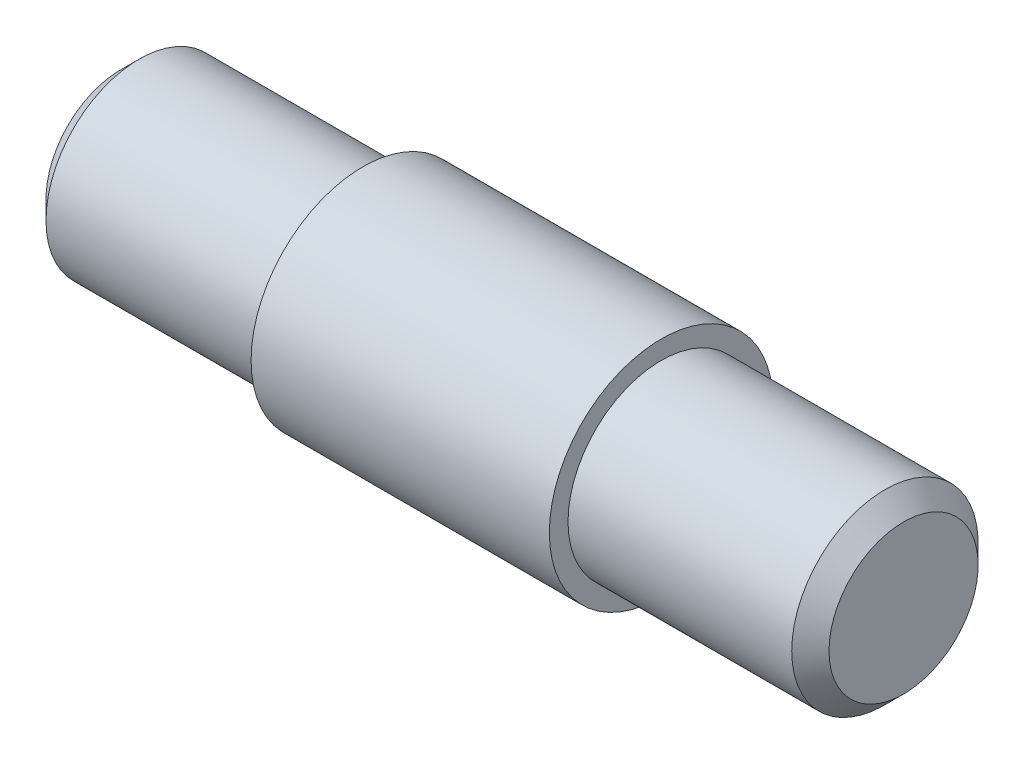
ISO-10303-21;
HEADER;
FILE_DESCRIPTION(('STEP AP214'),'2;1');
FILE_NAME('part.step','',(''),(''),'','','');
FILE_SCHEMA(('AUTOMOTIVE_DESIGN { 1 0 10303 214 1 1 1 1 }'));
ENDSEC;
DATA;
#1=APPLICATION_CONTEXT('core data for automotive mechanical design processes');
#2=APPLICATION_PROTOCOL_DEFINITION('international standard','automotive_design',2000,#1);
#3=PRODUCT_CONTEXT('',#1,'mechanical');
#4=PRODUCT('Part','Part','',(#3));
#5=PRODUCT_RELATED_PRODUCT_CATEGORY('part','',(#4));
#6=PRODUCT_DEFINITION_FORMATION('','',#4);
#7=PRODUCT_DEFINITION_CONTEXT('part definition',#1,'design');
#8=PRODUCT_DEFINITION('design','',#6,#7);
#9=PRODUCT_DEFINITION_SHAPE('','',#8);
#10=(LENGTH_UNIT() NAMED_UNIT(*) SI_UNIT(.MILLI.,.METRE.));
#11=(NAMED_UNIT(*) PLANE_ANGLE_UNIT() SI_UNIT($,.RADIAN.));
#12=(NAMED_UNIT(*) SI_UNIT($,.STERADIAN.) SOLID_ANGLE_UNIT());
#13=UNCERTAINTY_MEASURE_WITH_UNIT(LENGTH_MEASURE(1.E-05),#10,'distance_accuracy_value','');
#14=(GEOMETRIC_REPRESENTATION_CONTEXT(3) GLOBAL_UNCERTAINTY_ASSIGNED_CONTEXT((#13)) GLOBAL_UNIT_ASSIGNED_CONTEXT((#10,
#11,#12)) REPRESENTATION_CONTEXT('',''));
#15=CARTESIAN_POINT('',(0.,0.,0.));
#16=DIRECTION('',(0.,0.,1.));
#17=DIRECTION('',(1.,0.,0.));
#18=AXIS2_PLACEMENT_3D('',#15,#16,#17);
#19=CARTESIAN_POINT('',(0.,0.,0.));
#20=DIRECTION('',(1.,0.,0.));
#21=DIRECTION('',(0.,0.,-1.));
#22=AXIS2_PLACEMENT_3D('',#19,#20,#21);
#23=PLANE('',#22);
#24=CARTESIAN_POINT('',(0.,0.,0.));
#25=DIRECTION('',(1.,0.,0.));
#26=DIRECTION('',(0.,0.,-1.));
#27=AXIS2_PLACEMENT_3D('',#24,#25,#26);
#28=CIRCLE('',#27,2.);
#29=CARTESIAN_POINT('',(0.,0.,-2.));
#30=VERTEX_POINT('',#29);
#31=EDGE_CURVE('E42',#30,#30,#28,.F.);
#32=ORIENTED_EDGE('',*,*,#31,.T.);
#33=EDGE_LOOP('',(#32));
#34=FACE_BOUND('',#33,.T.);
#35=ADVANCED_FACE('F35',(#34),#23,.F.);
#36=CARTESIAN_POINT('',(-54.8246366619784,0.,0.));
#37=DIRECTION('',(-1.,0.,0.));
#38=DIRECTION('',(0.,0.,1.));
#39=AXIS2_PLACEMENT_3D('',#36,#37,#38);
#40=CYLINDRICAL_SURFACE('',#39,2.5);
#41=CARTESIAN_POINT('',(0.499999999999994,0.,0.));
#42=DIRECTION('',(1.,0.,0.));
#43=DIRECTION('',(0.,0.,-1.));
#44=AXIS2_PLACEMENT_3D('',#41,#42,#43);
#45=CIRCLE('',#44,2.5);
#46=CARTESIAN_POINT('',(0.499999999999994,0.,-2.5));
#47=VERTEX_POINT('',#46);
#48=EDGE_CURVE('E10',#47,#47,#45,.T.);
#49=ORIENTED_EDGE('',*,*,#48,.T.);
#50=EDGE_LOOP('',(#49));
#51=FACE_BOUND('',#50,.T.);
#52=CARTESIAN_POINT('',(6.5,0.,0.));
#53=DIRECTION('',(-1.,0.,0.));
#54=DIRECTION('',(0.,0.,1.));
#55=AXIS2_PLACEMENT_3D('',#52,#53,#54);
#56=CIRCLE('',#55,2.5);
#57=CARTESIAN_POINT('',(6.5,0.,2.5));
#58=VERTEX_POINT('',#57);
#59=EDGE_CURVE('E55',#58,#58,#56,.T.);
#60=ORIENTED_EDGE('',*,*,#59,.T.);
#61=EDGE_LOOP('',(#60));
#62=FACE_BOUND('',#61,.T.);
#63=ADVANCED_FACE('F86',(#51,#62),#40,.T.);
#64=CARTESIAN_POINT('',(6.5,2.5,0.));
#65=DIRECTION('',(1.,0.,0.));
#66=DIRECTION('',(0.,0.,-1.));
#67=AXIS2_PLACEMENT_3D('',#64,#65,#66);
#68=PLANE('',#67);
#69=ORIENTED_EDGE('',*,*,#59,.F.);
#70=EDGE_LOOP('',(#69));
#71=FACE_BOUND('',#70,.T.);
#72=CARTESIAN_POINT('',(6.5,0.,0.));
#73=DIRECTION('',(-1.,0.,0.));
#74=DIRECTION('',(0.,0.,1.));
#75=AXIS2_PLACEMENT_3D('',#72,#73,#74);
#76=CIRCLE('',#75,3.);
#77=CARTESIAN_POINT('',(6.5,0.,3.));
#78=VERTEX_POINT('',#77);
#79=EDGE_CURVE('E58',#78,#78,#76,.T.);
#80=ORIENTED_EDGE('',*,*,#79,.T.);
#81=EDGE_LOOP('',(#80));
#82=FACE_BOUND('',#81,.T.);
#83=ADVANCED_FACE('F91',(#71,#82),#68,.F.);
#84=CARTESIAN_POINT('',(-54.8246366619784,0.,0.));
#85=DIRECTION('',(-1.,0.,0.));
#86=DIRECTION('',(0.,0.,1.));
#87=AXIS2_PLACEMENT_3D('',#84,#85,#86);
#88=CYLINDRICAL_SURFACE('',#87,3.);
#89=ORIENTED_EDGE('',*,*,#79,.F.);
#90=EDGE_LOOP('',(#89));
#91=FACE_BOUND('',#90,.T.);
#92=CARTESIAN_POINT('',(14.5,0.,0.));
#93=DIRECTION('',(-1.,0.,0.));
#94=DIRECTION('',(0.,0.,1.));
#95=AXIS2_PLACEMENT_3D('',#92,#93,#94);
#96=CIRCLE('',#95,3.);
#97=CARTESIAN_POINT('',(14.5,0.,3.));
#98=VERTEX_POINT('',#97);
#99=EDGE_CURVE('E61',#98,#98,#96,.T.);
#100=ORIENTED_EDGE('',*,*,#99,.T.);
#101=EDGE_LOOP('',(#100));
#102=FACE_BOUND('',#101,.T.);
#103=ADVANCED_FACE('F82',(#91,#102),#88,.T.);
#104=CARTESIAN_POINT('',(14.5,3.,0.));
#105=DIRECTION('',(-1.,0.,0.));
#106=DIRECTION('',(0.,0.,1.));
#107=AXIS2_PLACEMENT_3D('',#104,#105,#106);
#108=PLANE('',#107);
#109=ORIENTED_EDGE('',*,*,#99,.F.);
#110=EDGE_LOOP('',(#109));
#111=FACE_BOUND('',#110,.T.);
#112=CARTESIAN_POINT('',(14.5,0.,0.));
#113=DIRECTION('',(-1.,0.,0.));
#114=DIRECTION('',(0.,0.,1.));
#115=AXIS2_PLACEMENT_3D('',#112,#113,#114);
#116=CIRCLE('',#115,2.5);
#117=CARTESIAN_POINT('',(14.5,0.,2.5));
#118=VERTEX_POINT('',#117);
#119=EDGE_CURVE('E64',#118,#118,#116,.T.);
#120=ORIENTED_EDGE('',*,*,#119,.T.);
#121=EDGE_LOOP('',(#120));
#122=FACE_BOUND('',#121,.T.);
#123=ADVANCED_FACE('F68',(#111,#122),#108,.F.);
#124=CARTESIAN_POINT('',(-54.8246366619784,0.,0.));
#125=DIRECTION('',(-1.,0.,0.));
#126=DIRECTION('',(0.,0.,1.));
#127=AXIS2_PLACEMENT_3D('',#124,#125,#126);
#128=CYLINDRICAL_SURFACE('',#127,2.5);
#129=CARTESIAN_POINT('',(20.5,0.,0.));
#130=DIRECTION('',(-1.,0.,0.));
#131=DIRECTION('',(0.,0.,1.));
#132=AXIS2_PLACEMENT_3D('',#129,#130,#131);
#133=CIRCLE('',#132,2.5);
#134=CARTESIAN_POINT('',(20.5,0.,2.5));
#135=VERTEX_POINT('',#134);
#136=EDGE_CURVE('E50',#135,#135,#133,.T.);
#137=ORIENTED_EDGE('',*,*,#136,.T.);
#138=EDGE_LOOP('',(#137));
#139=FACE_BOUND('',#138,.T.);
#140=ORIENTED_EDGE('',*,*,#119,.F.);
#141=EDGE_LOOP('',(#140));
#142=FACE_BOUND('',#141,.T.);
#143=ADVANCED_FACE('F70',(#139,#142),#128,.T.);
#144=CARTESIAN_POINT('',(21.,2.5,0.));
#145=DIRECTION('',(-1.,0.,0.));
#146=DIRECTION('',(0.,0.,1.));
#147=AXIS2_PLACEMENT_3D('',#144,#145,#146);
#148=PLANE('',#147);
#149=CARTESIAN_POINT('',(21.,0.,0.));
#150=DIRECTION('',(-1.,0.,0.));
#151=DIRECTION('',(0.,0.,1.));
#152=AXIS2_PLACEMENT_3D('',#149,#150,#151);
#153=CIRCLE('',#152,1.99999999999999);
#154=CARTESIAN_POINT('',(21.,0.,1.99999999999999));
#155=VERTEX_POINT('',#154);
#156=EDGE_CURVE('E46',#155,#155,#153,.F.);
#157=ORIENTED_EDGE('',*,*,#156,.T.);
#158=EDGE_LOOP('',(#157));
#159=FACE_BOUND('',#158,.T.);
#160=ADVANCED_FACE('F72',(#159),#148,.F.);
#161=CARTESIAN_POINT('',(20.5,0.,0.));
#162=DIRECTION('',(-1.,0.,0.));
#163=DIRECTION('',(0.,0.,1.));
#164=AXIS2_PLACEMENT_3D('',#161,#162,#163);
#165=CONICAL_SURFACE('',#164,2.5,0.785398163397463);
#166=ORIENTED_EDGE('',*,*,#156,.F.);
#167=EDGE_LOOP('',(#166));
#168=FACE_BOUND('',#167,.T.);
#169=ORIENTED_EDGE('',*,*,#136,.F.);
#170=EDGE_LOOP('',(#169));
#171=FACE_BOUND('',#170,.T.);
#172=ADVANCED_FACE('F79',(#168,#171),#165,.T.);
#173=CARTESIAN_POINT('',(0.,0.,0.));
#174=DIRECTION('',(1.,0.,0.));
#175=DIRECTION('',(0.,0.,-1.));
#176=AXIS2_PLACEMENT_3D('',#173,#174,#175);
#177=CONICAL_SURFACE('',#176,2.,0.78539816339745);
#178=ORIENTED_EDGE('',*,*,#48,.F.);
#179=EDGE_LOOP('',(#178));
#180=FACE_BOUND('',#179,.T.);
#181=ORIENTED_EDGE('',*,*,#31,.F.);
#182=EDGE_LOOP('',(#181));
#183=FACE_BOUND('',#182,.T.);
#184=ADVANCED_FACE('F37',(#180,#183),#177,.T.);
#185=CLOSED_SHELL('',(#35,#63,#83,#103,#123,#143,#160,#172,#184));
#186=MANIFOLD_SOLID_BREP('B2',#185);
#187=ADVANCED_BREP_SHAPE_REPRESENTATION('',(#18,#186),#14);
#188=SHAPE_DEFINITION_REPRESENTATION(#9,#187);
ENDSEC;
END-ISO-10303-21;
